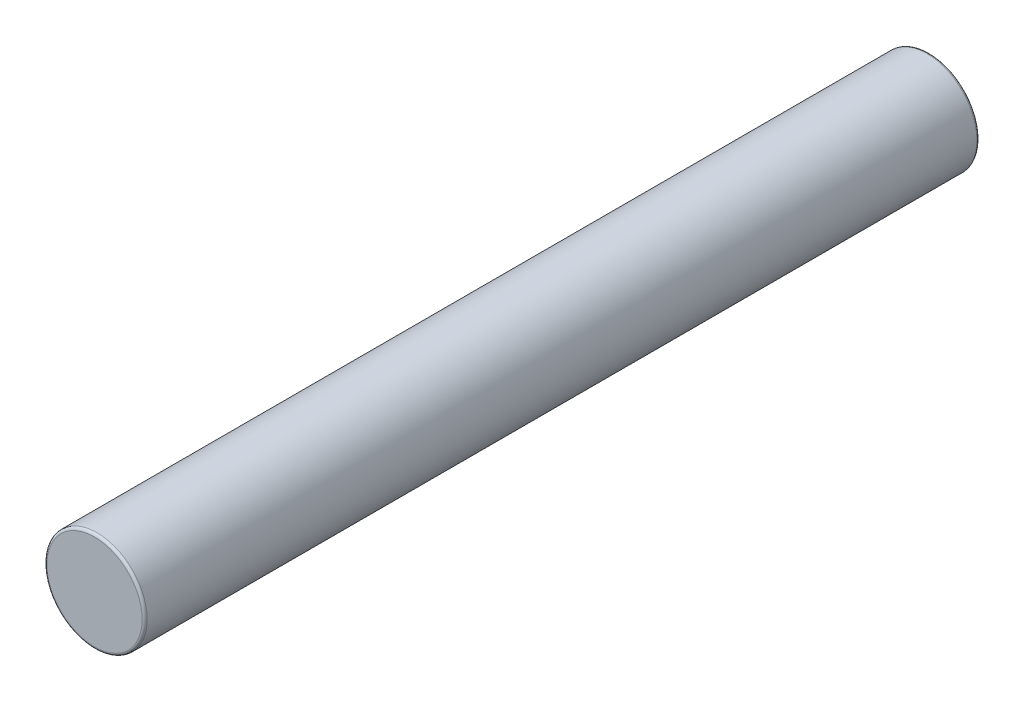
ISO-10303-21;
HEADER;
FILE_DESCRIPTION(('STEP AP214'),'2;1');
FILE_NAME('part.step','',(''),(''),'','','');
FILE_SCHEMA(('AUTOMOTIVE_DESIGN { 1 0 10303 214 1 1 1 1 }'));
ENDSEC;
DATA;
#1=APPLICATION_CONTEXT('core data for automotive mechanical design processes');
#2=APPLICATION_PROTOCOL_DEFINITION('international standard','automotive_design',2000,#1);
#3=PRODUCT_CONTEXT('',#1,'mechanical');
#4=PRODUCT('Part','Part','',(#3));
#5=PRODUCT_RELATED_PRODUCT_CATEGORY('part','',(#4));
#6=PRODUCT_DEFINITION_FORMATION('','',#4);
#7=PRODUCT_DEFINITION_CONTEXT('part definition',#1,'design');
#8=PRODUCT_DEFINITION('design','',#6,#7);
#9=PRODUCT_DEFINITION_SHAPE('','',#8);
#10=(LENGTH_UNIT() NAMED_UNIT(*) SI_UNIT(.MILLI.,.METRE.));
#11=(NAMED_UNIT(*) PLANE_ANGLE_UNIT() SI_UNIT($,.RADIAN.));
#12=(NAMED_UNIT(*) SI_UNIT($,.STERADIAN.) SOLID_ANGLE_UNIT());
#13=UNCERTAINTY_MEASURE_WITH_UNIT(LENGTH_MEASURE(1.E-05),#10,'distance_accuracy_value','');
#14=(GEOMETRIC_REPRESENTATION_CONTEXT(3) GLOBAL_UNCERTAINTY_ASSIGNED_CONTEXT((#13)) GLOBAL_UNIT_ASSIGNED_CONTEXT((#10,
#11,#12)) REPRESENTATION_CONTEXT('',''));
#15=CARTESIAN_POINT('',(0.,0.,0.));
#16=DIRECTION('',(0.,0.,1.));
#17=DIRECTION('',(1.,0.,0.));
#18=AXIS2_PLACEMENT_3D('',#15,#16,#17);
#19=CARTESIAN_POINT('',(0.,0.,-25.));
#20=DIRECTION('',(0.,0.,1.));
#21=DIRECTION('',(1.,0.,0.));
#22=AXIS2_PLACEMENT_3D('',#19,#20,#21);
#23=CYLINDRICAL_SURFACE('',#22,1.5);
#24=CARTESIAN_POINT('',(0.,0.,-0.0749999999999987));
#25=DIRECTION('',(0.,0.,1.));
#26=DIRECTION('',(1.,0.,0.));
#27=AXIS2_PLACEMENT_3D('',#24,#25,#26);
#28=CIRCLE('',#27,1.5);
#29=CARTESIAN_POINT('',(1.5,0.,-0.0749999999999987));
#30=VERTEX_POINT('',#29);
#31=EDGE_CURVE('E38',#30,#30,#28,.F.);
#32=ORIENTED_EDGE('',*,*,#31,.T.);
#33=EDGE_LOOP('',(#32));
#34=FACE_BOUND('',#33,.T.);
#35=CARTESIAN_POINT('',(0.,0.,-24.925));
#36=DIRECTION('',(0.,0.,1.));
#37=DIRECTION('',(1.,0.,0.));
#38=AXIS2_PLACEMENT_3D('',#35,#36,#37);
#39=CIRCLE('',#38,1.5);
#40=CARTESIAN_POINT('',(1.5,0.,-24.925));
#41=VERTEX_POINT('',#40);
#42=EDGE_CURVE('E42',#41,#41,#39,.T.);
#43=ORIENTED_EDGE('',*,*,#42,.T.);
#44=EDGE_LOOP('',(#43));
#45=FACE_BOUND('',#44,.T.);
#46=ADVANCED_FACE('F31',(#34,#45),#23,.T.);
#47=CARTESIAN_POINT('',(0.,0.,-25.));
#48=DIRECTION('',(0.,0.,1.));
#49=DIRECTION('',(1.,0.,0.));
#50=AXIS2_PLACEMENT_3D('',#47,#48,#49);
#51=PLANE('',#50);
#52=CARTESIAN_POINT('',(0.,0.,-25.));
#53=DIRECTION('',(0.,0.,1.));
#54=DIRECTION('',(1.,0.,0.));
#55=AXIS2_PLACEMENT_3D('',#52,#53,#54);
#56=CIRCLE('',#55,1.425);
#57=CARTESIAN_POINT('',(1.425,0.,-25.));
#58=VERTEX_POINT('',#57);
#59=EDGE_CURVE('E10',#58,#58,#56,.F.);
#60=ORIENTED_EDGE('',*,*,#59,.T.);
#61=EDGE_LOOP('',(#60));
#62=FACE_BOUND('',#61,.T.);
#63=ADVANCED_FACE('F62',(#62),#51,.F.);
#64=CARTESIAN_POINT('',(0.,0.,0.));
#65=DIRECTION('',(0.,0.,1.));
#66=DIRECTION('',(1.,0.,0.));
#67=AXIS2_PLACEMENT_3D('',#64,#65,#66);
#68=PLANE('',#67);
#69=CARTESIAN_POINT('',(0.,0.,0.));
#70=DIRECTION('',(0.,0.,1.));
#71=DIRECTION('',(1.,0.,0.));
#72=AXIS2_PLACEMENT_3D('',#69,#70,#71);
#73=CIRCLE('',#72,1.425);
#74=CARTESIAN_POINT('',(1.425,0.,0.));
#75=VERTEX_POINT('',#74);
#76=EDGE_CURVE('E46',#75,#75,#73,.T.);
#77=ORIENTED_EDGE('',*,*,#76,.T.);
#78=EDGE_LOOP('',(#77));
#79=FACE_BOUND('',#78,.T.);
#80=ADVANCED_FACE('F52',(#79),#68,.T.);
#81=CARTESIAN_POINT('',(0.,0.,-0.0749999999999987));
#82=DIRECTION('',(0.,0.,1.));
#83=DIRECTION('',(1.,0.,0.));
#84=AXIS2_PLACEMENT_3D('',#81,#82,#83);
#85=TOROIDAL_SURFACE('',#84,1.425,0.075);
#86=ORIENTED_EDGE('',*,*,#31,.F.);
#87=EDGE_LOOP('',(#86));
#88=FACE_BOUND('',#87,.T.);
#89=ORIENTED_EDGE('',*,*,#76,.F.);
#90=EDGE_LOOP('',(#89));
#91=FACE_BOUND('',#90,.T.);
#92=ADVANCED_FACE('F54',(#88,#91),#85,.T.);
#93=CARTESIAN_POINT('',(0.,0.,-24.925));
#94=DIRECTION('',(0.,0.,1.));
#95=DIRECTION('',(1.,0.,0.));
#96=AXIS2_PLACEMENT_3D('',#93,#94,#95);
#97=TOROIDAL_SURFACE('',#96,1.425,0.075);
#98=ORIENTED_EDGE('',*,*,#59,.F.);
#99=EDGE_LOOP('',(#98));
#100=FACE_BOUND('',#99,.T.);
#101=ORIENTED_EDGE('',*,*,#42,.F.);
#102=EDGE_LOOP('',(#101));
#103=FACE_BOUND('',#102,.T.);
#104=ADVANCED_FACE('F33',(#100,#103),#97,.T.);
#105=CLOSED_SHELL('',(#46,#63,#80,#92,#104));
#106=MANIFOLD_SOLID_BREP('B2',#105);
#107=ADVANCED_BREP_SHAPE_REPRESENTATION('',(#18,#106),#14);
#108=SHAPE_DEFINITION_REPRESENTATION(#9,#107);
ENDSEC;
END-ISO-10303-21;
